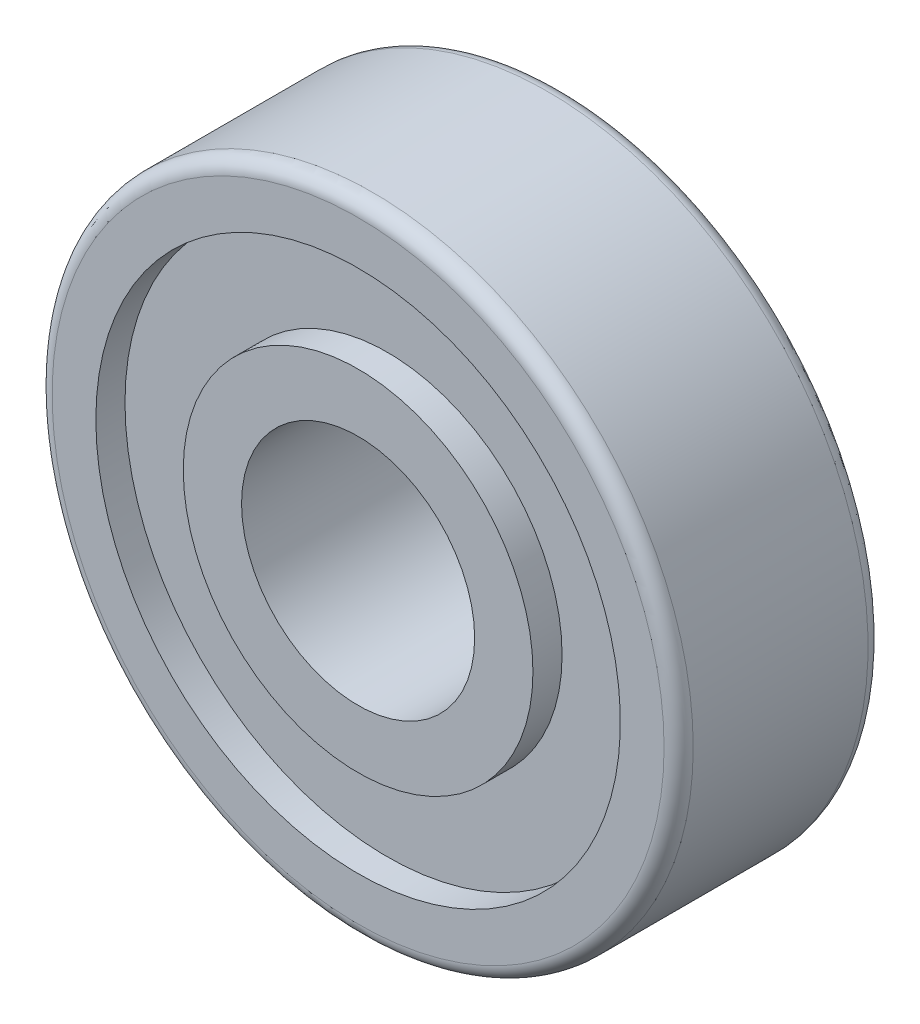
ISO-10303-21;
HEADER;
FILE_DESCRIPTION(('STEP AP214'),'2;1');
FILE_NAME('part.step','',(''),(''),'','','');
FILE_SCHEMA(('AUTOMOTIVE_DESIGN { 1 0 10303 214 1 1 1 1 }'));
ENDSEC;
DATA;
#1=APPLICATION_CONTEXT('core data for automotive mechanical design processes');
#2=APPLICATION_PROTOCOL_DEFINITION('international standard','automotive_design',2000,#1);
#3=PRODUCT_CONTEXT('',#1,'mechanical');
#4=PRODUCT('Part','Part','',(#3));
#5=PRODUCT_RELATED_PRODUCT_CATEGORY('part','',(#4));
#6=PRODUCT_DEFINITION_FORMATION('','',#4);
#7=PRODUCT_DEFINITION_CONTEXT('part definition',#1,'design');
#8=PRODUCT_DEFINITION('design','',#6,#7);
#9=PRODUCT_DEFINITION_SHAPE('','',#8);
#10=(LENGTH_UNIT() NAMED_UNIT(*) SI_UNIT(.MILLI.,.METRE.));
#11=(NAMED_UNIT(*) PLANE_ANGLE_UNIT() SI_UNIT($,.RADIAN.));
#12=(NAMED_UNIT(*) SI_UNIT($,.STERADIAN.) SOLID_ANGLE_UNIT());
#13=UNCERTAINTY_MEASURE_WITH_UNIT(LENGTH_MEASURE(1.E-05),#10,'distance_accuracy_value','');
#14=(GEOMETRIC_REPRESENTATION_CONTEXT(3) GLOBAL_UNCERTAINTY_ASSIGNED_CONTEXT((#13)) GLOBAL_UNIT_ASSIGNED_CONTEXT((#10,
#11,#12)) REPRESENTATION_CONTEXT('',''));
#15=CARTESIAN_POINT('',(0.,0.,0.));
#16=DIRECTION('',(0.,0.,1.));
#17=DIRECTION('',(1.,0.,0.));
#18=AXIS2_PLACEMENT_3D('',#15,#16,#17);
#19=CARTESIAN_POINT('',(4.,0.,-3.5));
#20=DIRECTION('',(0.,0.,-1.));
#21=DIRECTION('',(-1.,0.,0.));
#22=AXIS2_PLACEMENT_3D('',#19,#20,#21);
#23=PLANE('',#22);
#24=CARTESIAN_POINT('',(0.,0.,-3.5));
#25=DIRECTION('',(0.,0.,-1.));
#26=DIRECTION('',(-1.,0.,0.));
#27=AXIS2_PLACEMENT_3D('',#24,#25,#26);
#28=CIRCLE('',#27,6.);
#29=CARTESIAN_POINT('',(-6.,0.,-3.5));
#30=VERTEX_POINT('',#29);
#31=EDGE_CURVE('E65',#30,#30,#28,.T.);
#32=ORIENTED_EDGE('',*,*,#31,.T.);
#33=EDGE_LOOP('',(#32));
#34=FACE_BOUND('',#33,.T.);
#35=CARTESIAN_POINT('',(0.,0.,-3.5));
#36=DIRECTION('',(0.,0.,-1.));
#37=DIRECTION('',(-1.,0.,0.));
#38=AXIS2_PLACEMENT_3D('',#35,#36,#37);
#39=CIRCLE('',#38,4.);
#40=CARTESIAN_POINT('',(-4.,0.,-3.5));
#41=VERTEX_POINT('',#40);
#42=EDGE_CURVE('E98',#41,#41,#39,.T.);
#43=ORIENTED_EDGE('',*,*,#42,.F.);
#44=EDGE_LOOP('',(#43));
#45=FACE_BOUND('',#44,.T.);
#46=ADVANCED_FACE('F38',(#34,#45),#23,.T.);
#47=CARTESIAN_POINT('',(0.,0.,3.5));
#48=DIRECTION('',(0.,0.,-1.));
#49=DIRECTION('',(-1.,0.,0.));
#50=AXIS2_PLACEMENT_3D('',#47,#48,#49);
#51=CYLINDRICAL_SURFACE('',#50,6.);
#52=CARTESIAN_POINT('',(0.,0.,-2.5));
#53=DIRECTION('',(0.,0.,-1.));
#54=DIRECTION('',(-1.,0.,0.));
#55=AXIS2_PLACEMENT_3D('',#52,#53,#54);
#56=CIRCLE('',#55,6.);
#57=CARTESIAN_POINT('',(-6.,0.,-2.5));
#58=VERTEX_POINT('',#57);
#59=EDGE_CURVE('E69',#58,#58,#56,.T.);
#60=ORIENTED_EDGE('',*,*,#59,.T.);
#61=EDGE_LOOP('',(#60));
#62=FACE_BOUND('',#61,.T.);
#63=ORIENTED_EDGE('',*,*,#31,.F.);
#64=EDGE_LOOP('',(#63));
#65=FACE_BOUND('',#64,.T.);
#66=ADVANCED_FACE('F107',(#62,#65),#51,.T.);
#67=CARTESIAN_POINT('',(6.,0.,-2.5));
#68=DIRECTION('',(0.,0.,-1.));
#69=DIRECTION('',(-1.,0.,0.));
#70=AXIS2_PLACEMENT_3D('',#67,#68,#69);
#71=PLANE('',#70);
#72=CARTESIAN_POINT('',(0.,0.,-2.5));
#73=DIRECTION('',(0.,0.,-1.));
#74=DIRECTION('',(-1.,0.,0.));
#75=AXIS2_PLACEMENT_3D('',#72,#73,#74);
#76=CIRCLE('',#75,9.);
#77=CARTESIAN_POINT('',(-9.,0.,-2.5));
#78=VERTEX_POINT('',#77);
#79=EDGE_CURVE('E73',#78,#78,#76,.T.);
#80=ORIENTED_EDGE('',*,*,#79,.T.);
#81=EDGE_LOOP('',(#80));
#82=FACE_BOUND('',#81,.T.);
#83=ORIENTED_EDGE('',*,*,#59,.F.);
#84=EDGE_LOOP('',(#83));
#85=FACE_BOUND('',#84,.T.);
#86=ADVANCED_FACE('F113',(#82,#85),#71,.T.);
#87=CARTESIAN_POINT('',(0.,0.,3.5));
#88=DIRECTION('',(0.,0.,-1.));
#89=DIRECTION('',(-1.,0.,0.));
#90=AXIS2_PLACEMENT_3D('',#87,#88,#89);
#91=CYLINDRICAL_SURFACE('',#90,9.);
#92=CARTESIAN_POINT('',(0.,0.,-3.5));
#93=DIRECTION('',(0.,0.,-1.));
#94=DIRECTION('',(-1.,0.,0.));
#95=AXIS2_PLACEMENT_3D('',#92,#93,#94);
#96=CIRCLE('',#95,9.);
#97=CARTESIAN_POINT('',(-9.,0.,-3.5));
#98=VERTEX_POINT('',#97);
#99=EDGE_CURVE('E76',#98,#98,#96,.T.);
#100=ORIENTED_EDGE('',*,*,#99,.T.);
#101=EDGE_LOOP('',(#100));
#102=FACE_BOUND('',#101,.T.);
#103=ORIENTED_EDGE('',*,*,#79,.F.);
#104=EDGE_LOOP('',(#103));
#105=FACE_BOUND('',#104,.T.);
#106=ADVANCED_FACE('F134',(#102,#105),#91,.F.);
#107=CARTESIAN_POINT('',(9.,0.,-3.5));
#108=DIRECTION('',(0.,0.,-1.));
#109=DIRECTION('',(-1.,0.,0.));
#110=AXIS2_PLACEMENT_3D('',#107,#108,#109);
#111=PLANE('',#110);
#112=CARTESIAN_POINT('',(0.,0.,-3.5));
#113=DIRECTION('',(0.,0.,-1.));
#114=DIRECTION('',(-1.,0.,0.));
#115=AXIS2_PLACEMENT_3D('',#112,#113,#114);
#116=CIRCLE('',#115,10.5);
#117=CARTESIAN_POINT('',(-10.5,0.,-3.5));
#118=VERTEX_POINT('',#117);
#119=EDGE_CURVE('E60',#118,#118,#116,.T.);
#120=ORIENTED_EDGE('',*,*,#119,.T.);
#121=EDGE_LOOP('',(#120));
#122=FACE_BOUND('',#121,.T.);
#123=ORIENTED_EDGE('',*,*,#99,.F.);
#124=EDGE_LOOP('',(#123));
#125=FACE_BOUND('',#124,.T.);
#126=ADVANCED_FACE('F130',(#122,#125),#111,.T.);
#127=CARTESIAN_POINT('',(0.,0.,3.5));
#128=DIRECTION('',(0.,0.,-1.));
#129=DIRECTION('',(-1.,0.,0.));
#130=AXIS2_PLACEMENT_3D('',#127,#128,#129);
#131=CYLINDRICAL_SURFACE('',#130,11.);
#132=CARTESIAN_POINT('',(0.,0.,-3.));
#133=DIRECTION('',(0.,0.,-1.));
#134=DIRECTION('',(-1.,0.,0.));
#135=AXIS2_PLACEMENT_3D('',#132,#133,#134);
#136=CIRCLE('',#135,11.);
#137=CARTESIAN_POINT('',(-11.,0.,-3.));
#138=VERTEX_POINT('',#137);
#139=EDGE_CURVE('E46',#138,#138,#136,.F.);
#140=ORIENTED_EDGE('',*,*,#139,.T.);
#141=EDGE_LOOP('',(#140));
#142=FACE_BOUND('',#141,.T.);
#143=CARTESIAN_POINT('',(0.,0.,3.));
#144=DIRECTION('',(0.,0.,1.));
#145=DIRECTION('',(1.,0.,0.));
#146=AXIS2_PLACEMENT_3D('',#143,#144,#145);
#147=CIRCLE('',#146,11.);
#148=CARTESIAN_POINT('',(11.,0.,3.));
#149=VERTEX_POINT('',#148);
#150=EDGE_CURVE('E53',#149,#149,#147,.F.);
#151=ORIENTED_EDGE('',*,*,#150,.T.);
#152=EDGE_LOOP('',(#151));
#153=FACE_BOUND('',#152,.T.);
#154=ADVANCED_FACE('F133',(#142,#153),#131,.T.);
#155=CARTESIAN_POINT('',(11.,0.,3.5));
#156=DIRECTION('',(0.,0.,1.));
#157=DIRECTION('',(1.,0.,0.));
#158=AXIS2_PLACEMENT_3D('',#155,#156,#157);
#159=PLANE('',#158);
#160=CARTESIAN_POINT('',(0.,0.,3.5));
#161=DIRECTION('',(0.,0.,1.));
#162=DIRECTION('',(1.,0.,0.));
#163=AXIS2_PLACEMENT_3D('',#160,#161,#162);
#164=CIRCLE('',#163,10.5);
#165=CARTESIAN_POINT('',(10.5,0.,3.5));
#166=VERTEX_POINT('',#165);
#167=EDGE_CURVE('E10',#166,#166,#164,.T.);
#168=ORIENTED_EDGE('',*,*,#167,.T.);
#169=EDGE_LOOP('',(#168));
#170=FACE_BOUND('',#169,.T.);
#171=CARTESIAN_POINT('',(0.,0.,3.5));
#172=DIRECTION('',(0.,0.,-1.));
#173=DIRECTION('',(-1.,0.,0.));
#174=AXIS2_PLACEMENT_3D('',#171,#172,#173);
#175=CIRCLE('',#174,9.);
#176=CARTESIAN_POINT('',(-9.,0.,3.5));
#177=VERTEX_POINT('',#176);
#178=EDGE_CURVE('E80',#177,#177,#175,.T.);
#179=ORIENTED_EDGE('',*,*,#178,.T.);
#180=EDGE_LOOP('',(#179));
#181=FACE_BOUND('',#180,.T.);
#182=ADVANCED_FACE('F153',(#170,#181),#159,.T.);
#183=CARTESIAN_POINT('',(0.,0.,3.5));
#184=DIRECTION('',(0.,0.,-1.));
#185=DIRECTION('',(-1.,0.,0.));
#186=AXIS2_PLACEMENT_3D('',#183,#184,#185);
#187=CYLINDRICAL_SURFACE('',#186,9.);
#188=CARTESIAN_POINT('',(0.,0.,2.5));
#189=DIRECTION('',(0.,0.,-1.));
#190=DIRECTION('',(-1.,0.,0.));
#191=AXIS2_PLACEMENT_3D('',#188,#189,#190);
#192=CIRCLE('',#191,9.);
#193=CARTESIAN_POINT('',(-9.,0.,2.5));
#194=VERTEX_POINT('',#193);
#195=EDGE_CURVE('E83',#194,#194,#192,.T.);
#196=ORIENTED_EDGE('',*,*,#195,.T.);
#197=EDGE_LOOP('',(#196));
#198=FACE_BOUND('',#197,.T.);
#199=ORIENTED_EDGE('',*,*,#178,.F.);
#200=EDGE_LOOP('',(#199));
#201=FACE_BOUND('',#200,.T.);
#202=ADVANCED_FACE('F156',(#198,#201),#187,.F.);
#203=CARTESIAN_POINT('',(9.,0.,2.5));
#204=DIRECTION('',(0.,0.,1.));
#205=DIRECTION('',(1.,0.,0.));
#206=AXIS2_PLACEMENT_3D('',#203,#204,#205);
#207=PLANE('',#206);
#208=CARTESIAN_POINT('',(0.,0.,2.5));
#209=DIRECTION('',(0.,0.,-1.));
#210=DIRECTION('',(-1.,0.,0.));
#211=AXIS2_PLACEMENT_3D('',#208,#209,#210);
#212=CIRCLE('',#211,6.);
#213=CARTESIAN_POINT('',(-6.,0.,2.5));
#214=VERTEX_POINT('',#213);
#215=EDGE_CURVE('E86',#214,#214,#212,.T.);
#216=ORIENTED_EDGE('',*,*,#215,.T.);
#217=EDGE_LOOP('',(#216));
#218=FACE_BOUND('',#217,.T.);
#219=ORIENTED_EDGE('',*,*,#195,.F.);
#220=EDGE_LOOP('',(#219));
#221=FACE_BOUND('',#220,.T.);
#222=ADVANCED_FACE('F159',(#218,#221),#207,.T.);
#223=CARTESIAN_POINT('',(0.,0.,3.5));
#224=DIRECTION('',(0.,0.,-1.));
#225=DIRECTION('',(-1.,0.,0.));
#226=AXIS2_PLACEMENT_3D('',#223,#224,#225);
#227=CYLINDRICAL_SURFACE('',#226,6.);
#228=CARTESIAN_POINT('',(0.,0.,3.5));
#229=DIRECTION('',(0.,0.,-1.));
#230=DIRECTION('',(-1.,0.,0.));
#231=AXIS2_PLACEMENT_3D('',#228,#229,#230);
#232=CIRCLE('',#231,6.);
#233=CARTESIAN_POINT('',(-6.,0.,3.5));
#234=VERTEX_POINT('',#233);
#235=EDGE_CURVE('E90',#234,#234,#232,.T.);
#236=ORIENTED_EDGE('',*,*,#235,.T.);
#237=EDGE_LOOP('',(#236));
#238=FACE_BOUND('',#237,.T.);
#239=ORIENTED_EDGE('',*,*,#215,.F.);
#240=EDGE_LOOP('',(#239));
#241=FACE_BOUND('',#240,.T.);
#242=ADVANCED_FACE('F163',(#238,#241),#227,.T.);
#243=CARTESIAN_POINT('',(6.,0.,3.5));
#244=DIRECTION('',(0.,0.,1.));
#245=DIRECTION('',(1.,0.,0.));
#246=AXIS2_PLACEMENT_3D('',#243,#244,#245);
#247=PLANE('',#246);
#248=CARTESIAN_POINT('',(0.,0.,3.5));
#249=DIRECTION('',(0.,0.,-1.));
#250=DIRECTION('',(-1.,0.,0.));
#251=AXIS2_PLACEMENT_3D('',#248,#249,#250);
#252=CIRCLE('',#251,4.);
#253=CARTESIAN_POINT('',(-4.,0.,3.5));
#254=VERTEX_POINT('',#253);
#255=EDGE_CURVE('E94',#254,#254,#252,.T.);
#256=ORIENTED_EDGE('',*,*,#255,.T.);
#257=EDGE_LOOP('',(#256));
#258=FACE_BOUND('',#257,.T.);
#259=ORIENTED_EDGE('',*,*,#235,.F.);
#260=EDGE_LOOP('',(#259));
#261=FACE_BOUND('',#260,.T.);
#262=ADVANCED_FACE('F125',(#258,#261),#247,.T.);
#263=CARTESIAN_POINT('',(0.,0.,3.5));
#264=DIRECTION('',(0.,0.,-1.));
#265=DIRECTION('',(-1.,0.,0.));
#266=AXIS2_PLACEMENT_3D('',#263,#264,#265);
#267=CYLINDRICAL_SURFACE('',#266,4.);
#268=ORIENTED_EDGE('',*,*,#42,.T.);
#269=EDGE_LOOP('',(#268));
#270=FACE_BOUND('',#269,.T.);
#271=ORIENTED_EDGE('',*,*,#255,.F.);
#272=EDGE_LOOP('',(#271));
#273=FACE_BOUND('',#272,.T.);
#274=ADVANCED_FACE('F103',(#270,#273),#267,.F.);
#275=CARTESIAN_POINT('',(0.,0.,-3.));
#276=DIRECTION('',(0.,0.,-1.));
#277=DIRECTION('',(-1.,0.,0.));
#278=AXIS2_PLACEMENT_3D('',#275,#276,#277);
#279=TOROIDAL_SURFACE('',#278,10.5,0.5);
#280=ORIENTED_EDGE('',*,*,#139,.F.);
#281=EDGE_LOOP('',(#280));
#282=FACE_BOUND('',#281,.T.);
#283=ORIENTED_EDGE('',*,*,#119,.F.);
#284=EDGE_LOOP('',(#283));
#285=FACE_BOUND('',#284,.T.);
#286=ADVANCED_FACE('F117',(#282,#285),#279,.T.);
#287=CARTESIAN_POINT('',(0.,0.,3.));
#288=DIRECTION('',(0.,0.,1.));
#289=DIRECTION('',(1.,0.,0.));
#290=AXIS2_PLACEMENT_3D('',#287,#288,#289);
#291=TOROIDAL_SURFACE('',#290,10.5,0.5);
#292=ORIENTED_EDGE('',*,*,#167,.F.);
#293=EDGE_LOOP('',(#292));
#294=FACE_BOUND('',#293,.T.);
#295=ORIENTED_EDGE('',*,*,#150,.F.);
#296=EDGE_LOOP('',(#295));
#297=FACE_BOUND('',#296,.T.);
#298=ADVANCED_FACE('F40',(#294,#297),#291,.T.);
#299=CLOSED_SHELL('',(#46,#66,#86,#106,#126,#154,#182,#202,#222,#242,#262,#274,#286,#298));
#300=MANIFOLD_SOLID_BREP('B2',#299);
#301=ADVANCED_BREP_SHAPE_REPRESENTATION('',(#18,#300),#14);
#302=SHAPE_DEFINITION_REPRESENTATION(#9,#301);
ENDSEC;
END-ISO-10303-21;
